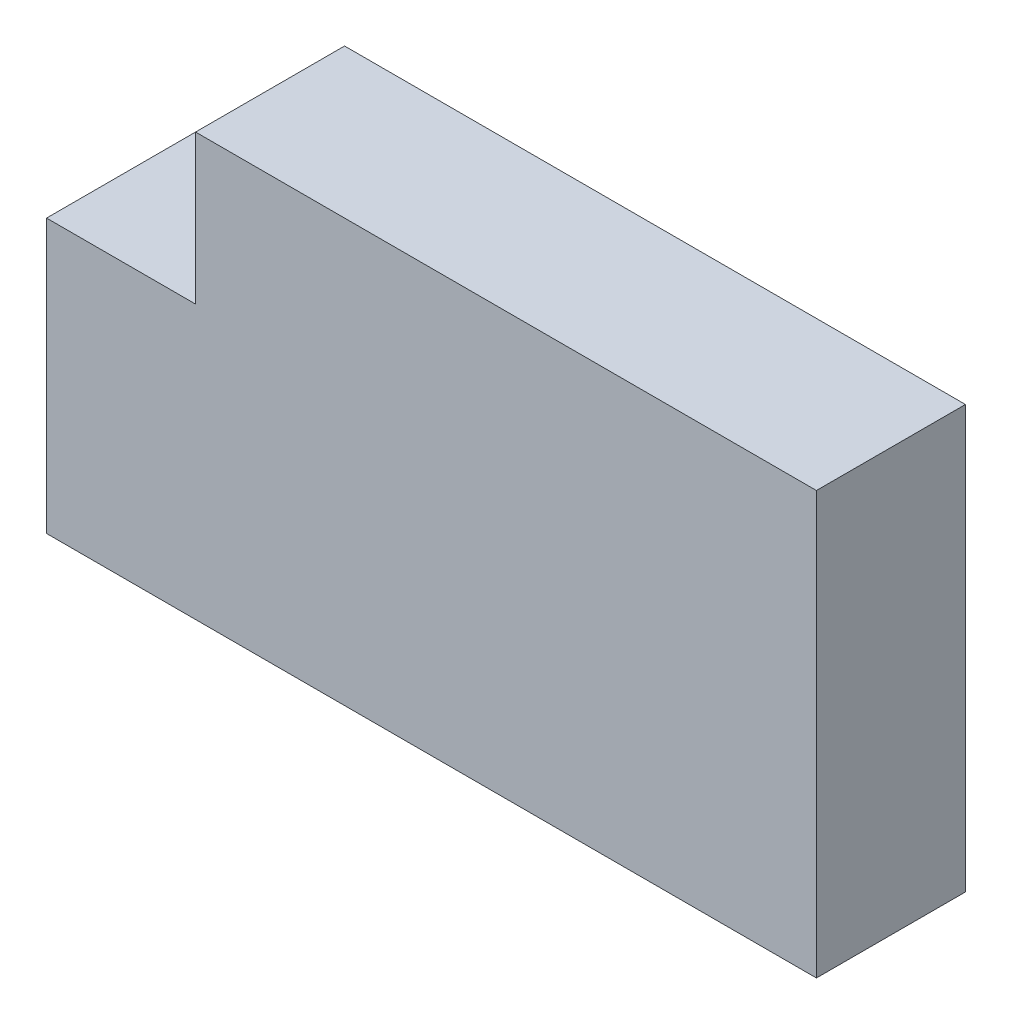
ISO-10303-21;
HEADER;
FILE_DESCRIPTION(('STEP AP214'),'2;1');
FILE_NAME('part.step','',(''),(''),'','','');
FILE_SCHEMA(('AUTOMOTIVE_DESIGN { 1 0 10303 214 1 1 1 1 }'));
ENDSEC;
DATA;
#1=APPLICATION_CONTEXT('core data for automotive mechanical design processes');
#2=APPLICATION_PROTOCOL_DEFINITION('international standard','automotive_design',2000,#1);
#3=PRODUCT_CONTEXT('',#1,'mechanical');
#4=PRODUCT('Part','Part','',(#3));
#5=PRODUCT_RELATED_PRODUCT_CATEGORY('part','',(#4));
#6=PRODUCT_DEFINITION_FORMATION('','',#4);
#7=PRODUCT_DEFINITION_CONTEXT('part definition',#1,'design');
#8=PRODUCT_DEFINITION('design','',#6,#7);
#9=PRODUCT_DEFINITION_SHAPE('','',#8);
#10=(LENGTH_UNIT() NAMED_UNIT(*) SI_UNIT(.MILLI.,.METRE.));
#11=(NAMED_UNIT(*) PLANE_ANGLE_UNIT() SI_UNIT($,.RADIAN.));
#12=(NAMED_UNIT(*) SI_UNIT($,.STERADIAN.) SOLID_ANGLE_UNIT());
#13=UNCERTAINTY_MEASURE_WITH_UNIT(LENGTH_MEASURE(1.E-05),#10,'distance_accuracy_value','');
#14=(GEOMETRIC_REPRESENTATION_CONTEXT(3) GLOBAL_UNCERTAINTY_ASSIGNED_CONTEXT((#13)) GLOBAL_UNIT_ASSIGNED_CONTEXT((#10,
#11,#12)) REPRESENTATION_CONTEXT('',''));
#15=CARTESIAN_POINT('',(0.,0.,0.));
#16=DIRECTION('',(0.,0.,1.));
#17=DIRECTION('',(1.,0.,0.));
#18=AXIS2_PLACEMENT_3D('',#15,#16,#17);
#19=CARTESIAN_POINT('',(31.,0.,6.));
#20=DIRECTION('',(1.,0.,0.));
#21=DIRECTION('',(0.,0.,-1.));
#22=AXIS2_PLACEMENT_3D('',#19,#20,#21);
#23=PLANE('',#22);
#24=DIRECTION('',(0.,-1.,0.));
#25=VECTOR('',#24,1.);
#26=CARTESIAN_POINT('',(31.,0.,0.));
#27=LINE('',#26,#25);
#28=CARTESIAN_POINT('',(31.,17.,0.));
#29=VERTEX_POINT('',#28);
#30=CARTESIAN_POINT('',(31.,0.,0.));
#31=VERTEX_POINT('',#30);
#32=EDGE_CURVE('E127',#29,#31,#27,.T.);
#33=ORIENTED_EDGE('',*,*,#32,.F.);
#34=DIRECTION('',(0.,0.,-1.));
#35=VECTOR('',#34,1.);
#36=CARTESIAN_POINT('',(31.,17.,6.));
#37=LINE('',#36,#35);
#38=CARTESIAN_POINT('',(31.,17.,6.));
#39=VERTEX_POINT('',#38);
#40=EDGE_CURVE('E11',#39,#29,#37,.T.);
#41=ORIENTED_EDGE('',*,*,#40,.F.);
#42=DIRECTION('',(0.,-1.,0.));
#43=VECTOR('',#42,1.);
#44=CARTESIAN_POINT('',(31.,0.,6.));
#45=LINE('',#44,#43);
#46=CARTESIAN_POINT('',(31.,0.,6.));
#47=VERTEX_POINT('',#46);
#48=EDGE_CURVE('E147',#39,#47,#45,.T.);
#49=ORIENTED_EDGE('',*,*,#48,.T.);
#50=DIRECTION('',(0.,0.,-1.));
#51=VECTOR('',#50,1.);
#52=CARTESIAN_POINT('',(31.,0.,6.));
#53=LINE('',#52,#51);
#54=EDGE_CURVE('E86',#47,#31,#53,.T.);
#55=ORIENTED_EDGE('',*,*,#54,.T.);
#56=EDGE_LOOP('',(#33,#41,#49,#55));
#57=FACE_BOUND('',#56,.T.);
#58=ADVANCED_FACE('F41',(#57),#23,.T.);
#59=CARTESIAN_POINT('',(0.,17.,6.));
#60=DIRECTION('',(0.,1.,0.));
#61=DIRECTION('',(0.,0.,1.));
#62=AXIS2_PLACEMENT_3D('',#59,#60,#61);
#63=PLANE('',#62);
#64=DIRECTION('',(1.,0.,0.));
#65=VECTOR('',#64,1.);
#66=CARTESIAN_POINT('',(0.,17.,0.));
#67=LINE('',#66,#65);
#68=CARTESIAN_POINT('',(6.,17.,0.));
#69=VERTEX_POINT('',#68);
#70=EDGE_CURVE('E131',#69,#29,#67,.T.);
#71=ORIENTED_EDGE('',*,*,#70,.F.);
#72=DIRECTION('',(0.,0.,-1.));
#73=VECTOR('',#72,1.);
#74=CARTESIAN_POINT('',(6.,17.,6.));
#75=LINE('',#74,#73);
#76=CARTESIAN_POINT('',(6.,17.,6.));
#77=VERTEX_POINT('',#76);
#78=EDGE_CURVE('E50',#77,#69,#75,.T.);
#79=ORIENTED_EDGE('',*,*,#78,.F.);
#80=DIRECTION('',(1.,0.,0.));
#81=VECTOR('',#80,1.);
#82=CARTESIAN_POINT('',(0.,17.,6.));
#83=LINE('',#82,#81);
#84=EDGE_CURVE('E163',#77,#39,#83,.T.);
#85=ORIENTED_EDGE('',*,*,#84,.T.);
#86=ORIENTED_EDGE('',*,*,#40,.T.);
#87=EDGE_LOOP('',(#71,#79,#85,#86));
#88=FACE_BOUND('',#87,.T.);
#89=ADVANCED_FACE('F162',(#88),#63,.T.);
#90=CARTESIAN_POINT('',(6.,0.,6.));
#91=DIRECTION('',(1.,0.,0.));
#92=DIRECTION('',(0.,0.,-1.));
#93=AXIS2_PLACEMENT_3D('',#90,#91,#92);
#94=PLANE('',#93);
#95=DIRECTION('',(0.,-1.,0.));
#96=VECTOR('',#95,1.);
#97=CARTESIAN_POINT('',(6.,0.,0.));
#98=LINE('',#97,#96);
#99=CARTESIAN_POINT('',(6.,11.,0.));
#100=VERTEX_POINT('',#99);
#101=EDGE_CURVE('E135',#69,#100,#98,.T.);
#102=ORIENTED_EDGE('',*,*,#101,.T.);
#103=DIRECTION('',(0.,0.,-1.));
#104=VECTOR('',#103,1.);
#105=CARTESIAN_POINT('',(6.,11.,6.));
#106=LINE('',#105,#104);
#107=CARTESIAN_POINT('',(6.,11.,6.));
#108=VERTEX_POINT('',#107);
#109=EDGE_CURVE('E110',#108,#100,#106,.T.);
#110=ORIENTED_EDGE('',*,*,#109,.F.);
#111=DIRECTION('',(0.,-1.,0.));
#112=VECTOR('',#111,1.);
#113=CARTESIAN_POINT('',(6.,0.,6.));
#114=LINE('',#113,#112);
#115=EDGE_CURVE('E116',#77,#108,#114,.T.);
#116=ORIENTED_EDGE('',*,*,#115,.F.);
#117=ORIENTED_EDGE('',*,*,#78,.T.);
#118=EDGE_LOOP('',(#102,#110,#116,#117));
#119=FACE_BOUND('',#118,.T.);
#120=ADVANCED_FACE('F156',(#119),#94,.F.);
#121=CARTESIAN_POINT('',(0.,11.,6.));
#122=DIRECTION('',(0.,1.,0.));
#123=DIRECTION('',(0.,0.,1.));
#124=AXIS2_PLACEMENT_3D('',#121,#122,#123);
#125=PLANE('',#124);
#126=DIRECTION('',(1.,0.,0.));
#127=VECTOR('',#126,1.);
#128=CARTESIAN_POINT('',(0.,11.,0.));
#129=LINE('',#128,#127);
#130=CARTESIAN_POINT('',(0.,11.,0.));
#131=VERTEX_POINT('',#130);
#132=EDGE_CURVE('E104',#131,#100,#129,.T.);
#133=ORIENTED_EDGE('',*,*,#132,.F.);
#134=DIRECTION('',(0.,0.,-1.));
#135=VECTOR('',#134,1.);
#136=CARTESIAN_POINT('',(0.,11.,6.));
#137=LINE('',#136,#135);
#138=CARTESIAN_POINT('',(0.,11.,6.));
#139=VERTEX_POINT('',#138);
#140=EDGE_CURVE('E99',#139,#131,#137,.T.);
#141=ORIENTED_EDGE('',*,*,#140,.F.);
#142=DIRECTION('',(1.,0.,0.));
#143=VECTOR('',#142,1.);
#144=CARTESIAN_POINT('',(0.,11.,6.));
#145=LINE('',#144,#143);
#146=EDGE_CURVE('E102',#139,#108,#145,.T.);
#147=ORIENTED_EDGE('',*,*,#146,.T.);
#148=ORIENTED_EDGE('',*,*,#109,.T.);
#149=EDGE_LOOP('',(#133,#141,#147,#148));
#150=FACE_BOUND('',#149,.T.);
#151=ADVANCED_FACE('F101',(#150),#125,.T.);
#152=CARTESIAN_POINT('',(0.,0.,6.));
#153=DIRECTION('',(-1.,0.,0.));
#154=DIRECTION('',(0.,-1.,0.));
#155=AXIS2_PLACEMENT_3D('',#152,#153,#154);
#156=PLANE('',#155);
#157=DIRECTION('',(0.,1.,0.));
#158=VECTOR('',#157,1.);
#159=CARTESIAN_POINT('',(0.,0.,0.));
#160=LINE('',#159,#158);
#161=CARTESIAN_POINT('',(0.,0.,0.));
#162=VERTEX_POINT('',#161);
#163=EDGE_CURVE('E141',#162,#131,#160,.T.);
#164=ORIENTED_EDGE('',*,*,#163,.F.);
#165=DIRECTION('',(0.,0.,-1.));
#166=VECTOR('',#165,1.);
#167=CARTESIAN_POINT('',(0.,0.,6.));
#168=LINE('',#167,#166);
#169=CARTESIAN_POINT('',(0.,0.,6.));
#170=VERTEX_POINT('',#169);
#171=EDGE_CURVE('E79',#170,#162,#168,.T.);
#172=ORIENTED_EDGE('',*,*,#171,.F.);
#173=DIRECTION('',(0.,1.,0.));
#174=VECTOR('',#173,1.);
#175=CARTESIAN_POINT('',(0.,0.,6.));
#176=LINE('',#175,#174);
#177=EDGE_CURVE('E113',#170,#139,#176,.T.);
#178=ORIENTED_EDGE('',*,*,#177,.T.);
#179=ORIENTED_EDGE('',*,*,#140,.T.);
#180=EDGE_LOOP('',(#164,#172,#178,#179));
#181=FACE_BOUND('',#180,.T.);
#182=ADVANCED_FACE('F120',(#181),#156,.T.);
#183=CARTESIAN_POINT('',(0.,0.,6.));
#184=DIRECTION('',(0.,1.,0.));
#185=DIRECTION('',(0.,0.,1.));
#186=AXIS2_PLACEMENT_3D('',#183,#184,#185);
#187=PLANE('',#186);
#188=DIRECTION('',(1.,0.,0.));
#189=VECTOR('',#188,1.);
#190=CARTESIAN_POINT('',(0.,0.,0.));
#191=LINE('',#190,#189);
#192=EDGE_CURVE('E144',#162,#31,#191,.T.);
#193=ORIENTED_EDGE('',*,*,#192,.T.);
#194=ORIENTED_EDGE('',*,*,#54,.F.);
#195=DIRECTION('',(1.,0.,0.));
#196=VECTOR('',#195,1.);
#197=CARTESIAN_POINT('',(0.,0.,6.));
#198=LINE('',#197,#196);
#199=EDGE_CURVE('E58',#170,#47,#198,.T.);
#200=ORIENTED_EDGE('',*,*,#199,.F.);
#201=ORIENTED_EDGE('',*,*,#171,.T.);
#202=EDGE_LOOP('',(#193,#194,#200,#201));
#203=FACE_BOUND('',#202,.T.);
#204=ADVANCED_FACE('F164',(#203),#187,.F.);
#205=CARTESIAN_POINT('',(0.,0.,6.));
#206=DIRECTION('',(0.,0.,1.));
#207=DIRECTION('',(1.,0.,0.));
#208=AXIS2_PLACEMENT_3D('',#205,#206,#207);
#209=PLANE('',#208);
#210=ORIENTED_EDGE('',*,*,#48,.F.);
#211=ORIENTED_EDGE('',*,*,#84,.F.);
#212=ORIENTED_EDGE('',*,*,#115,.T.);
#213=ORIENTED_EDGE('',*,*,#146,.F.);
#214=ORIENTED_EDGE('',*,*,#177,.F.);
#215=ORIENTED_EDGE('',*,*,#199,.T.);
#216=EDGE_LOOP('',(#210,#211,#212,#213,#214,#215));
#217=FACE_BOUND('',#216,.T.);
#218=ADVANCED_FACE('F112',(#217),#209,.T.);
#219=CARTESIAN_POINT('',(0.,0.,0.));
#220=DIRECTION('',(0.,0.,1.));
#221=DIRECTION('',(1.,0.,0.));
#222=AXIS2_PLACEMENT_3D('',#219,#220,#221);
#223=PLANE('',#222);
#224=ORIENTED_EDGE('',*,*,#32,.T.);
#225=ORIENTED_EDGE('',*,*,#192,.F.);
#226=ORIENTED_EDGE('',*,*,#163,.T.);
#227=ORIENTED_EDGE('',*,*,#132,.T.);
#228=ORIENTED_EDGE('',*,*,#101,.F.);
#229=ORIENTED_EDGE('',*,*,#70,.T.);
#230=EDGE_LOOP('',(#224,#225,#226,#227,#228,#229));
#231=FACE_BOUND('',#230,.T.);
#232=ADVANCED_FACE('F161',(#231),#223,.F.);
#233=CLOSED_SHELL('',(#58,#89,#120,#151,#182,#204,#218,#232));
#234=MANIFOLD_SOLID_BREP('B2',#233);
#235=ADVANCED_BREP_SHAPE_REPRESENTATION('',(#18,#234),#14);
#236=SHAPE_DEFINITION_REPRESENTATION(#9,#235);
ENDSEC;
END-ISO-10303-21;
